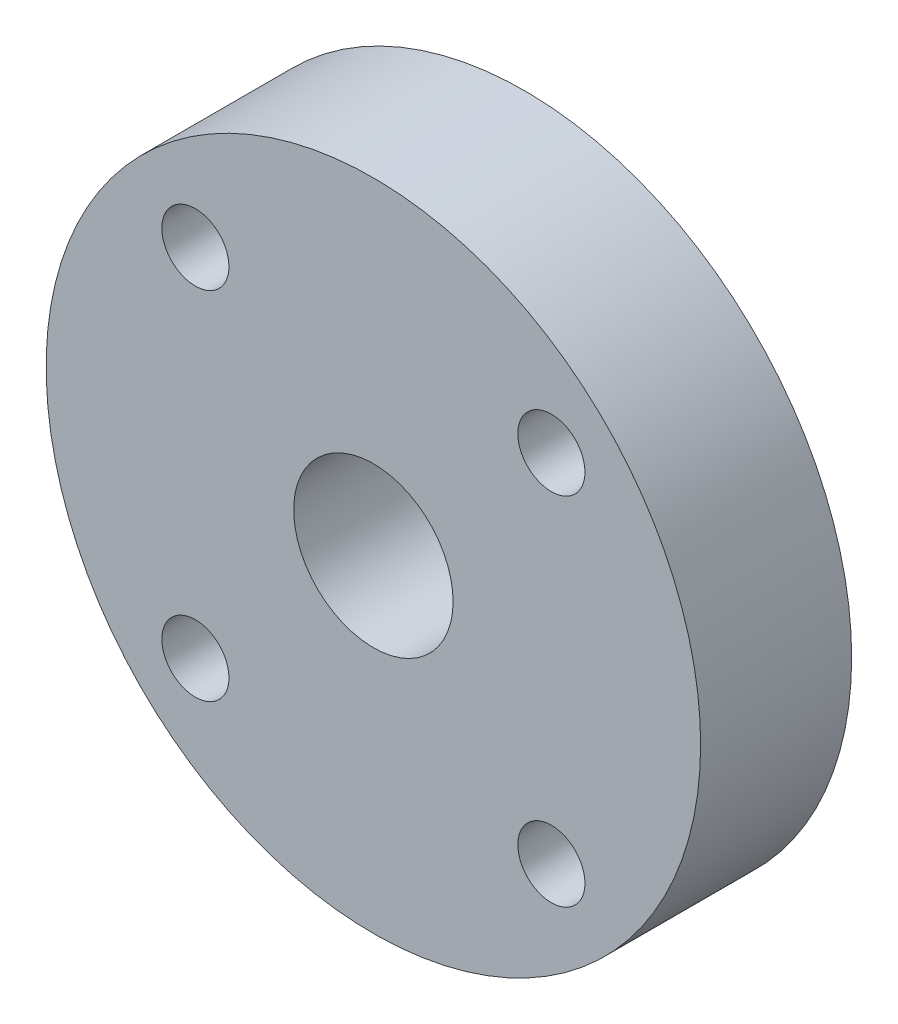
ISO-10303-21;
HEADER;
FILE_DESCRIPTION(('STEP AP214'),'2;1');
FILE_NAME('part.step','',(''),(''),'','','');
FILE_SCHEMA(('AUTOMOTIVE_DESIGN { 1 0 10303 214 1 1 1 1 }'));
ENDSEC;
DATA;
#1=APPLICATION_CONTEXT('core data for automotive mechanical design processes');
#2=APPLICATION_PROTOCOL_DEFINITION('international standard','automotive_design',2000,#1);
#3=PRODUCT_CONTEXT('',#1,'mechanical');
#4=PRODUCT('Part','Part','',(#3));
#5=PRODUCT_RELATED_PRODUCT_CATEGORY('part','',(#4));
#6=PRODUCT_DEFINITION_FORMATION('','',#4);
#7=PRODUCT_DEFINITION_CONTEXT('part definition',#1,'design');
#8=PRODUCT_DEFINITION('design','',#6,#7);
#9=PRODUCT_DEFINITION_SHAPE('','',#8);
#10=(LENGTH_UNIT() NAMED_UNIT(*) SI_UNIT(.MILLI.,.METRE.));
#11=(NAMED_UNIT(*) PLANE_ANGLE_UNIT() SI_UNIT($,.RADIAN.));
#12=(NAMED_UNIT(*) SI_UNIT($,.STERADIAN.) SOLID_ANGLE_UNIT());
#13=UNCERTAINTY_MEASURE_WITH_UNIT(LENGTH_MEASURE(1.E-05),#10,'distance_accuracy_value','');
#14=(GEOMETRIC_REPRESENTATION_CONTEXT(3) GLOBAL_UNCERTAINTY_ASSIGNED_CONTEXT((#13)) GLOBAL_UNIT_ASSIGNED_CONTEXT((#10,
#11,#12)) REPRESENTATION_CONTEXT('',''));
#15=CARTESIAN_POINT('',(0.,0.,0.));
#16=DIRECTION('',(0.,0.,1.));
#17=DIRECTION('',(1.,0.,0.));
#18=AXIS2_PLACEMENT_3D('',#15,#16,#17);
#19=CARTESIAN_POINT('',(-1.47196168001606E-13,-1.47196168001604E-13,18.));
#20=DIRECTION('',(0.,0.,1.));
#21=DIRECTION('',(1.,0.,0.));
#22=AXIS2_PLACEMENT_3D('',#19,#20,#21);
#23=PLANE('',#22);
#24=CARTESIAN_POINT('',(21.2132034355977,-21.2132034355952,18.));
#25=DIRECTION('',(0.,0.,1.));
#26=DIRECTION('',(1.,0.,0.));
#27=AXIS2_PLACEMENT_3D('',#24,#25,#26);
#28=CIRCLE('',#27,4.00000000000171);
#29=CARTESIAN_POINT('',(25.2132034355994,-21.2132034355952,18.));
#30=VERTEX_POINT('',#29);
#31=EDGE_CURVE('E59',#30,#30,#28,.T.);
#32=ORIENTED_EDGE('',*,*,#31,.F.);
#33=EDGE_LOOP('',(#32));
#34=FACE_BOUND('',#33,.T.);
#35=CARTESIAN_POINT('',(-1.47196168001606E-13,-1.47196168001604E-13,18.));
#36=DIRECTION('',(0.,0.,1.));
#37=DIRECTION('',(1.,0.,0.));
#38=AXIS2_PLACEMENT_3D('',#35,#36,#37);
#39=CIRCLE('',#38,9.5);
#40=CARTESIAN_POINT('',(9.49999999999985,-1.47196168001604E-13,18.));
#41=VERTEX_POINT('',#40);
#42=EDGE_CURVE('E47',#41,#41,#39,.T.);
#43=ORIENTED_EDGE('',*,*,#42,.F.);
#44=EDGE_LOOP('',(#43));
#45=FACE_BOUND('',#44,.T.);
#46=CARTESIAN_POINT('',(-1.47196168001606E-13,-1.47196168001604E-13,18.));
#47=DIRECTION('',(0.,0.,1.));
#48=DIRECTION('',(1.,0.,0.));
#49=AXIS2_PLACEMENT_3D('',#46,#47,#48);
#50=CIRCLE('',#49,39.0000000000001);
#51=CARTESIAN_POINT('',(38.9999999999999,-1.47196168001604E-13,18.));
#52=VERTEX_POINT('',#51);
#53=EDGE_CURVE('E10',#52,#52,#50,.T.);
#54=ORIENTED_EDGE('',*,*,#53,.T.);
#55=EDGE_LOOP('',(#54));
#56=FACE_BOUND('',#55,.T.);
#57=CARTESIAN_POINT('',(-21.2132034355966,21.2132034355962,18.));
#58=DIRECTION('',(0.,0.,1.));
#59=DIRECTION('',(1.,0.,0.));
#60=AXIS2_PLACEMENT_3D('',#57,#58,#59);
#61=CIRCLE('',#60,4.00000000000018);
#62=CARTESIAN_POINT('',(-17.2132034355964,21.2132034355962,18.));
#63=VERTEX_POINT('',#62);
#64=EDGE_CURVE('E42',#63,#63,#61,.T.);
#65=ORIENTED_EDGE('',*,*,#64,.F.);
#66=EDGE_LOOP('',(#65));
#67=FACE_BOUND('',#66,.T.);
#68=CARTESIAN_POINT('',(21.2132034355964,21.2132034355977,18.));
#69=DIRECTION('',(0.,0.,1.));
#70=DIRECTION('',(1.,0.,0.));
#71=AXIS2_PLACEMENT_3D('',#68,#69,#70);
#72=CIRCLE('',#71,4.00000000000125);
#73=CARTESIAN_POINT('',(25.2132034355976,21.2132034355977,18.));
#74=VERTEX_POINT('',#73);
#75=EDGE_CURVE('E53',#74,#74,#72,.T.);
#76=ORIENTED_EDGE('',*,*,#75,.F.);
#77=EDGE_LOOP('',(#76));
#78=FACE_BOUND('',#77,.T.);
#79=CARTESIAN_POINT('',(-21.2132034355952,-21.2132034355965,18.));
#80=DIRECTION('',(0.,0.,1.));
#81=DIRECTION('',(1.,0.,0.));
#82=AXIS2_PLACEMENT_3D('',#79,#80,#81);
#83=CIRCLE('',#82,4.00000000000064);
#84=CARTESIAN_POINT('',(-17.2132034355945,-21.2132034355965,18.));
#85=VERTEX_POINT('',#84);
#86=EDGE_CURVE('E65',#85,#85,#83,.T.);
#87=ORIENTED_EDGE('',*,*,#86,.F.);
#88=EDGE_LOOP('',(#87));
#89=FACE_BOUND('',#88,.T.);
#90=ADVANCED_FACE('F31',(#34,#45,#56,#67,#78,#89),#23,.T.);
#91=CARTESIAN_POINT('',(-1.47196168001606E-13,-1.47196168001604E-13,0.));
#92=DIRECTION('',(0.,0.,1.));
#93=DIRECTION('',(1.,0.,0.));
#94=AXIS2_PLACEMENT_3D('',#91,#92,#93);
#95=PLANE('',#94);
#96=CARTESIAN_POINT('',(-1.47196168001606E-13,-1.47196168001604E-13,0.));
#97=DIRECTION('',(0.,0.,1.));
#98=DIRECTION('',(1.,0.,0.));
#99=AXIS2_PLACEMENT_3D('',#96,#97,#98);
#100=CIRCLE('',#99,39.0000000000001);
#101=CARTESIAN_POINT('',(38.9999999999999,-1.47196168001604E-13,0.));
#102=VERTEX_POINT('',#101);
#103=EDGE_CURVE('E35',#102,#102,#100,.T.);
#104=ORIENTED_EDGE('',*,*,#103,.F.);
#105=EDGE_LOOP('',(#104));
#106=FACE_BOUND('',#105,.T.);
#107=CARTESIAN_POINT('',(-21.2132034355966,21.2132034355962,0.));
#108=DIRECTION('',(0.,0.,1.));
#109=DIRECTION('',(1.,0.,0.));
#110=AXIS2_PLACEMENT_3D('',#107,#108,#109);
#111=CIRCLE('',#110,4.00000000000018);
#112=CARTESIAN_POINT('',(-17.2132034355964,21.2132034355962,0.));
#113=VERTEX_POINT('',#112);
#114=EDGE_CURVE('E44',#113,#113,#111,.T.);
#115=ORIENTED_EDGE('',*,*,#114,.T.);
#116=EDGE_LOOP('',(#115));
#117=FACE_BOUND('',#116,.T.);
#118=CARTESIAN_POINT('',(-1.47196168001606E-13,-1.47196168001604E-13,0.));
#119=DIRECTION('',(0.,0.,1.));
#120=DIRECTION('',(1.,0.,0.));
#121=AXIS2_PLACEMENT_3D('',#118,#119,#120);
#122=CIRCLE('',#121,9.5);
#123=CARTESIAN_POINT('',(9.49999999999985,-1.47196168001604E-13,0.));
#124=VERTEX_POINT('',#123);
#125=EDGE_CURVE('E50',#124,#124,#122,.T.);
#126=ORIENTED_EDGE('',*,*,#125,.T.);
#127=EDGE_LOOP('',(#126));
#128=FACE_BOUND('',#127,.T.);
#129=CARTESIAN_POINT('',(21.2132034355964,21.2132034355977,0.));
#130=DIRECTION('',(0.,0.,1.));
#131=DIRECTION('',(1.,0.,0.));
#132=AXIS2_PLACEMENT_3D('',#129,#130,#131);
#133=CIRCLE('',#132,4.00000000000125);
#134=CARTESIAN_POINT('',(25.2132034355976,21.2132034355977,0.));
#135=VERTEX_POINT('',#134);
#136=EDGE_CURVE('E56',#135,#135,#133,.T.);
#137=ORIENTED_EDGE('',*,*,#136,.T.);
#138=EDGE_LOOP('',(#137));
#139=FACE_BOUND('',#138,.T.);
#140=CARTESIAN_POINT('',(21.2132034355977,-21.2132034355952,0.));
#141=DIRECTION('',(0.,0.,1.));
#142=DIRECTION('',(1.,0.,0.));
#143=AXIS2_PLACEMENT_3D('',#140,#141,#142);
#144=CIRCLE('',#143,4.00000000000171);
#145=CARTESIAN_POINT('',(25.2132034355994,-21.2132034355952,0.));
#146=VERTEX_POINT('',#145);
#147=EDGE_CURVE('E62',#146,#146,#144,.T.);
#148=ORIENTED_EDGE('',*,*,#147,.T.);
#149=EDGE_LOOP('',(#148));
#150=FACE_BOUND('',#149,.T.);
#151=CARTESIAN_POINT('',(-21.2132034355952,-21.2132034355965,0.));
#152=DIRECTION('',(0.,0.,1.));
#153=DIRECTION('',(1.,0.,0.));
#154=AXIS2_PLACEMENT_3D('',#151,#152,#153);
#155=CIRCLE('',#154,4.00000000000064);
#156=CARTESIAN_POINT('',(-17.2132034355945,-21.2132034355965,0.));
#157=VERTEX_POINT('',#156);
#158=EDGE_CURVE('E68',#157,#157,#155,.T.);
#159=ORIENTED_EDGE('',*,*,#158,.T.);
#160=EDGE_LOOP('',(#159));
#161=FACE_BOUND('',#160,.T.);
#162=ADVANCED_FACE('F78',(#106,#117,#128,#139,#150,#161),#95,.F.);
#163=CARTESIAN_POINT('',(-1.47196168001606E-13,-1.47196168001604E-13,18.));
#164=DIRECTION('',(0.,0.,-1.));
#165=DIRECTION('',(-1.,0.,0.));
#166=AXIS2_PLACEMENT_3D('',#163,#164,#165);
#167=CYLINDRICAL_SURFACE('',#166,39.0000000000001);
#168=ORIENTED_EDGE('',*,*,#53,.F.);
#169=EDGE_LOOP('',(#168));
#170=FACE_BOUND('',#169,.T.);
#171=ORIENTED_EDGE('',*,*,#103,.T.);
#172=EDGE_LOOP('',(#171));
#173=FACE_BOUND('',#172,.T.);
#174=ADVANCED_FACE('F33',(#170,#173),#167,.T.);
#175=CARTESIAN_POINT('',(-21.2132034355966,21.2132034355962,18.));
#176=DIRECTION('',(0.,0.,-1.));
#177=DIRECTION('',(-1.,0.,0.));
#178=AXIS2_PLACEMENT_3D('',#175,#176,#177);
#179=CYLINDRICAL_SURFACE('',#178,4.00000000000018);
#180=ORIENTED_EDGE('',*,*,#64,.T.);
#181=EDGE_LOOP('',(#180));
#182=FACE_BOUND('',#181,.T.);
#183=ORIENTED_EDGE('',*,*,#114,.F.);
#184=EDGE_LOOP('',(#183));
#185=FACE_BOUND('',#184,.T.);
#186=ADVANCED_FACE('F88',(#182,#185),#179,.F.);
#187=CARTESIAN_POINT('',(-1.47196168001606E-13,-1.47196168001604E-13,18.));
#188=DIRECTION('',(0.,0.,-1.));
#189=DIRECTION('',(-1.,0.,0.));
#190=AXIS2_PLACEMENT_3D('',#187,#188,#189);
#191=CYLINDRICAL_SURFACE('',#190,9.5);
#192=ORIENTED_EDGE('',*,*,#42,.T.);
#193=EDGE_LOOP('',(#192));
#194=FACE_BOUND('',#193,.T.);
#195=ORIENTED_EDGE('',*,*,#125,.F.);
#196=EDGE_LOOP('',(#195));
#197=FACE_BOUND('',#196,.T.);
#198=ADVANCED_FACE('F91',(#194,#197),#191,.F.);
#199=CARTESIAN_POINT('',(21.2132034355964,21.2132034355977,18.));
#200=DIRECTION('',(0.,0.,-1.));
#201=DIRECTION('',(-1.,0.,0.));
#202=AXIS2_PLACEMENT_3D('',#199,#200,#201);
#203=CYLINDRICAL_SURFACE('',#202,4.00000000000125);
#204=ORIENTED_EDGE('',*,*,#75,.T.);
#205=EDGE_LOOP('',(#204));
#206=FACE_BOUND('',#205,.T.);
#207=ORIENTED_EDGE('',*,*,#136,.F.);
#208=EDGE_LOOP('',(#207));
#209=FACE_BOUND('',#208,.T.);
#210=ADVANCED_FACE('F95',(#206,#209),#203,.F.);
#211=CARTESIAN_POINT('',(21.2132034355977,-21.2132034355952,18.));
#212=DIRECTION('',(0.,0.,-1.));
#213=DIRECTION('',(-1.,0.,0.));
#214=AXIS2_PLACEMENT_3D('',#211,#212,#213);
#215=CYLINDRICAL_SURFACE('',#214,4.00000000000171);
#216=ORIENTED_EDGE('',*,*,#31,.T.);
#217=EDGE_LOOP('',(#216));
#218=FACE_BOUND('',#217,.T.);
#219=ORIENTED_EDGE('',*,*,#147,.F.);
#220=EDGE_LOOP('',(#219));
#221=FACE_BOUND('',#220,.T.);
#222=ADVANCED_FACE('F99',(#218,#221),#215,.F.);
#223=CARTESIAN_POINT('',(-21.2132034355952,-21.2132034355965,18.));
#224=DIRECTION('',(0.,0.,-1.));
#225=DIRECTION('',(-1.,0.,0.));
#226=AXIS2_PLACEMENT_3D('',#223,#224,#225);
#227=CYLINDRICAL_SURFACE('',#226,4.00000000000064);
#228=ORIENTED_EDGE('',*,*,#86,.T.);
#229=EDGE_LOOP('',(#228));
#230=FACE_BOUND('',#229,.T.);
#231=ORIENTED_EDGE('',*,*,#158,.F.);
#232=EDGE_LOOP('',(#231));
#233=FACE_BOUND('',#232,.T.);
#234=ADVANCED_FACE('F74',(#230,#233),#227,.F.);
#235=CLOSED_SHELL('',(#90,#162,#174,#186,#198,#210,#222,#234));
#236=MANIFOLD_SOLID_BREP('B2',#235);
#237=ADVANCED_BREP_SHAPE_REPRESENTATION('',(#18,#236),#14);
#238=SHAPE_DEFINITION_REPRESENTATION(#9,#237);
ENDSEC;
END-ISO-10303-21;
